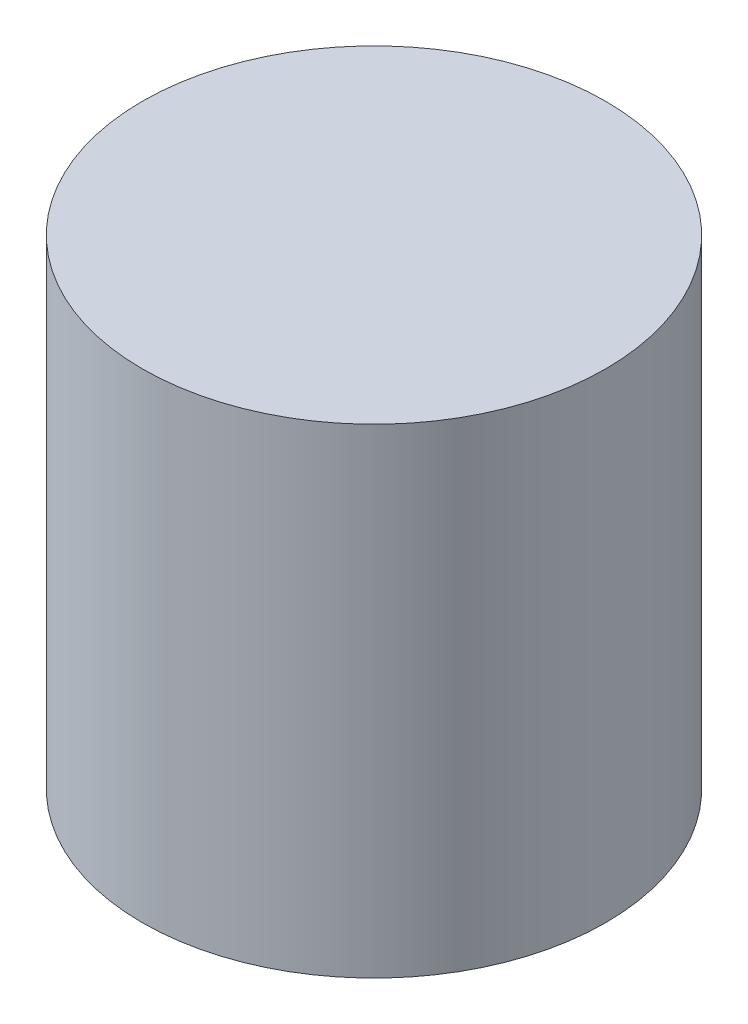
ISO-10303-21;
HEADER;
FILE_DESCRIPTION(('STEP AP214'),'2;1');
FILE_NAME('part.step','',(''),(''),'','','');
FILE_SCHEMA(('AUTOMOTIVE_DESIGN { 1 0 10303 214 1 1 1 1 }'));
ENDSEC;
DATA;
#1=APPLICATION_CONTEXT('core data for automotive mechanical design processes');
#2=APPLICATION_PROTOCOL_DEFINITION('international standard','automotive_design',2000,#1);
#3=PRODUCT_CONTEXT('',#1,'mechanical');
#4=PRODUCT('Part','Part','',(#3));
#5=PRODUCT_RELATED_PRODUCT_CATEGORY('part','',(#4));
#6=PRODUCT_DEFINITION_FORMATION('','',#4);
#7=PRODUCT_DEFINITION_CONTEXT('part definition',#1,'design');
#8=PRODUCT_DEFINITION('design','',#6,#7);
#9=PRODUCT_DEFINITION_SHAPE('','',#8);
#10=(LENGTH_UNIT() NAMED_UNIT(*) SI_UNIT(.MILLI.,.METRE.));
#11=(NAMED_UNIT(*) PLANE_ANGLE_UNIT() SI_UNIT($,.RADIAN.));
#12=(NAMED_UNIT(*) SI_UNIT($,.STERADIAN.) SOLID_ANGLE_UNIT());
#13=UNCERTAINTY_MEASURE_WITH_UNIT(LENGTH_MEASURE(1.E-05),#10,'distance_accuracy_value','');
#14=(GEOMETRIC_REPRESENTATION_CONTEXT(3) GLOBAL_UNCERTAINTY_ASSIGNED_CONTEXT((#13)) GLOBAL_UNIT_ASSIGNED_CONTEXT((#10,
#11,#12)) REPRESENTATION_CONTEXT('',''));
#15=CARTESIAN_POINT('',(0.,0.,0.));
#16=DIRECTION('',(0.,0.,1.));
#17=DIRECTION('',(1.,0.,0.));
#18=AXIS2_PLACEMENT_3D('',#15,#16,#17);
#19=CARTESIAN_POINT('',(-15.3207631100476,22.77,-23.2270195588847));
#20=DIRECTION('',(0.,-1.,0.));
#21=DIRECTION('',(0.,0.,-1.));
#22=AXIS2_PLACEMENT_3D('',#19,#20,#21);
#23=CYLINDRICAL_SURFACE('',#22,11.);
#24=CARTESIAN_POINT('',(-15.3207631100476,22.77,-23.2270195588847));
#25=DIRECTION('',(0.,1.,0.));
#26=DIRECTION('',(0.,0.,1.));
#27=AXIS2_PLACEMENT_3D('',#24,#25,#26);
#28=CIRCLE('',#27,11.);
#29=CARTESIAN_POINT('',(-15.3207631100476,22.77,-12.2270195588847));
#30=VERTEX_POINT('',#29);
#31=EDGE_CURVE('E10',#30,#30,#28,.T.);
#32=ORIENTED_EDGE('',*,*,#31,.F.);
#33=EDGE_LOOP('',(#32));
#34=FACE_BOUND('',#33,.T.);
#35=CARTESIAN_POINT('',(-15.3207631100476,0.,-23.2270195588847));
#36=DIRECTION('',(0.,1.,0.));
#37=DIRECTION('',(0.,0.,1.));
#38=AXIS2_PLACEMENT_3D('',#35,#36,#37);
#39=CIRCLE('',#38,11.);
#40=CARTESIAN_POINT('',(-15.3207631100476,0.,-12.2270195588847));
#41=VERTEX_POINT('',#40);
#42=EDGE_CURVE('E42',#41,#41,#39,.T.);
#43=ORIENTED_EDGE('',*,*,#42,.T.);
#44=EDGE_LOOP('',(#43));
#45=FACE_BOUND('',#44,.T.);
#46=ADVANCED_FACE('F39',(#34,#45),#23,.T.);
#47=CARTESIAN_POINT('',(-15.3207631100476,22.77,-23.2270195588847));
#48=DIRECTION('',(0.,1.,0.));
#49=DIRECTION('',(0.,0.,1.));
#50=AXIS2_PLACEMENT_3D('',#47,#48,#49);
#51=PLANE('',#50);
#52=ORIENTED_EDGE('',*,*,#31,.T.);
#53=EDGE_LOOP('',(#52));
#54=FACE_BOUND('',#53,.T.);
#55=ADVANCED_FACE('F54',(#54),#51,.T.);
#56=CARTESIAN_POINT('',(-15.3207631100476,0.,-23.2270195588847));
#57=DIRECTION('',(0.,1.,0.));
#58=DIRECTION('',(0.,0.,1.));
#59=AXIS2_PLACEMENT_3D('',#56,#57,#58);
#60=PLANE('',#59);
#61=ORIENTED_EDGE('',*,*,#42,.F.);
#62=EDGE_LOOP('',(#61));
#63=FACE_BOUND('',#62,.T.);
#64=ADVANCED_FACE('F52',(#63),#60,.F.);
#65=CLOSED_SHELL('',(#46,#55,#64));
#66=MANIFOLD_SOLID_BREP('B2',#65);
#67=ADVANCED_BREP_SHAPE_REPRESENTATION('',(#18,#66),#14);
#68=SHAPE_DEFINITION_REPRESENTATION(#9,#67);
ENDSEC;
END-ISO-10303-21;
